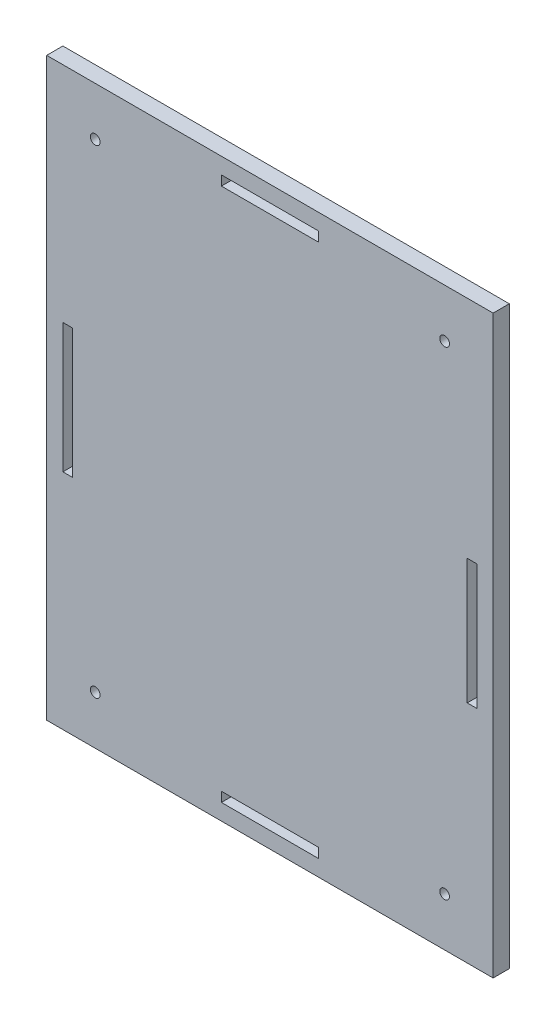
ISO-10303-21;
HEADER;
FILE_DESCRIPTION(('STEP AP214'),'2;1');
FILE_NAME('part.step','',(''),(''),'','','');
FILE_SCHEMA(('AUTOMOTIVE_DESIGN { 1 0 10303 214 1 1 1 1 }'));
ENDSEC;
DATA;
#1=APPLICATION_CONTEXT('core data for automotive mechanical design processes');
#2=APPLICATION_PROTOCOL_DEFINITION('international standard','automotive_design',2000,#1);
#3=PRODUCT_CONTEXT('',#1,'mechanical');
#4=PRODUCT('Part','Part','',(#3));
#5=PRODUCT_RELATED_PRODUCT_CATEGORY('part','',(#4));
#6=PRODUCT_DEFINITION_FORMATION('','',#4);
#7=PRODUCT_DEFINITION_CONTEXT('part definition',#1,'design');
#8=PRODUCT_DEFINITION('design','',#6,#7);
#9=PRODUCT_DEFINITION_SHAPE('','',#8);
#10=(LENGTH_UNIT() NAMED_UNIT(*) SI_UNIT(.MILLI.,.METRE.));
#11=(NAMED_UNIT(*) PLANE_ANGLE_UNIT() SI_UNIT($,.RADIAN.));
#12=(NAMED_UNIT(*) SI_UNIT($,.STERADIAN.) SOLID_ANGLE_UNIT());
#13=UNCERTAINTY_MEASURE_WITH_UNIT(LENGTH_MEASURE(1.E-05),#10,'distance_accuracy_value','');
#14=(GEOMETRIC_REPRESENTATION_CONTEXT(3) GLOBAL_UNCERTAINTY_ASSIGNED_CONTEXT((#13)) GLOBAL_UNIT_ASSIGNED_CONTEXT((#10,
#11,#12)) REPRESENTATION_CONTEXT('',''));
#15=CARTESIAN_POINT('',(0.,0.,0.));
#16=DIRECTION('',(0.,0.,1.));
#17=DIRECTION('',(1.,0.,0.));
#18=AXIS2_PLACEMENT_3D('',#15,#16,#17);
#19=CARTESIAN_POINT('',(-69.,-89.,5.));
#20=DIRECTION('',(1.,0.,0.));
#21=DIRECTION('',(0.,0.,-1.));
#22=AXIS2_PLACEMENT_3D('',#19,#20,#21);
#23=PLANE('',#22);
#24=DIRECTION('',(0.,-1.,0.));
#25=VECTOR('',#24,1.);
#26=CARTESIAN_POINT('',(-69.,-89.,0.));
#27=LINE('',#26,#25);
#28=CARTESIAN_POINT('',(-69.,89.,0.));
#29=VERTEX_POINT('',#28);
#30=CARTESIAN_POINT('',(-69.,-89.,0.));
#31=VERTEX_POINT('',#30);
#32=EDGE_CURVE('E262',#29,#31,#27,.T.);
#33=ORIENTED_EDGE('',*,*,#32,.T.);
#34=DIRECTION('',(0.,0.,-1.));
#35=VECTOR('',#34,1.);
#36=CARTESIAN_POINT('',(-69.,-89.,5.));
#37=LINE('',#36,#35);
#38=CARTESIAN_POINT('',(-69.,-89.,5.));
#39=VERTEX_POINT('',#38);
#40=EDGE_CURVE('E295',#39,#31,#37,.T.);
#41=ORIENTED_EDGE('',*,*,#40,.F.);
#42=DIRECTION('',(0.,-1.,0.));
#43=VECTOR('',#42,1.);
#44=CARTESIAN_POINT('',(-69.,-89.,5.));
#45=LINE('',#44,#43);
#46=CARTESIAN_POINT('',(-69.,89.,5.));
#47=VERTEX_POINT('',#46);
#48=EDGE_CURVE('E269',#47,#39,#45,.T.);
#49=ORIENTED_EDGE('',*,*,#48,.F.);
#50=DIRECTION('',(0.,0.,-1.));
#51=VECTOR('',#50,1.);
#52=CARTESIAN_POINT('',(-69.,89.,5.));
#53=LINE('',#52,#51);
#54=EDGE_CURVE('E279',#47,#29,#53,.T.);
#55=ORIENTED_EDGE('',*,*,#54,.T.);
#56=EDGE_LOOP('',(#33,#41,#49,#55));
#57=FACE_BOUND('',#56,.T.);
#58=ADVANCED_FACE('F32',(#57),#23,.F.);
#59=CARTESIAN_POINT('',(69.,-89.,5.));
#60=DIRECTION('',(0.,1.,0.));
#61=DIRECTION('',(-1.,0.,0.));
#62=AXIS2_PLACEMENT_3D('',#59,#60,#61);
#63=PLANE('',#62);
#64=DIRECTION('',(1.,0.,0.));
#65=VECTOR('',#64,1.);
#66=CARTESIAN_POINT('',(69.,-89.,0.));
#67=LINE('',#66,#65);
#68=CARTESIAN_POINT('',(69.,-89.,0.));
#69=VERTEX_POINT('',#68);
#70=EDGE_CURVE('E282',#31,#69,#67,.T.);
#71=ORIENTED_EDGE('',*,*,#70,.T.);
#72=DIRECTION('',(0.,0.,-1.));
#73=VECTOR('',#72,1.);
#74=CARTESIAN_POINT('',(69.,-89.,5.));
#75=LINE('',#74,#73);
#76=CARTESIAN_POINT('',(69.,-89.,5.));
#77=VERTEX_POINT('',#76);
#78=EDGE_CURVE('E292',#77,#69,#75,.T.);
#79=ORIENTED_EDGE('',*,*,#78,.F.);
#80=DIRECTION('',(1.,0.,0.));
#81=VECTOR('',#80,1.);
#82=CARTESIAN_POINT('',(69.,-89.,5.));
#83=LINE('',#82,#81);
#84=EDGE_CURVE('E272',#39,#77,#83,.T.);
#85=ORIENTED_EDGE('',*,*,#84,.F.);
#86=ORIENTED_EDGE('',*,*,#40,.T.);
#87=EDGE_LOOP('',(#71,#79,#85,#86));
#88=FACE_BOUND('',#87,.T.);
#89=ADVANCED_FACE('F346',(#88),#63,.F.);
#90=CARTESIAN_POINT('',(69.,-89.,5.));
#91=DIRECTION('',(-1.,0.,0.));
#92=DIRECTION('',(0.,0.,1.));
#93=AXIS2_PLACEMENT_3D('',#90,#91,#92);
#94=PLANE('',#93);
#95=DIRECTION('',(0.,1.,0.));
#96=VECTOR('',#95,1.);
#97=CARTESIAN_POINT('',(69.,-89.,0.));
#98=LINE('',#97,#96);
#99=CARTESIAN_POINT('',(69.,89.,0.));
#100=VERTEX_POINT('',#99);
#101=EDGE_CURVE('E284',#69,#100,#98,.T.);
#102=ORIENTED_EDGE('',*,*,#101,.T.);
#103=DIRECTION('',(0.,0.,-1.));
#104=VECTOR('',#103,1.);
#105=CARTESIAN_POINT('',(69.,89.,5.));
#106=LINE('',#105,#104);
#107=CARTESIAN_POINT('',(69.,89.,5.));
#108=VERTEX_POINT('',#107);
#109=EDGE_CURVE('E289',#108,#100,#106,.T.);
#110=ORIENTED_EDGE('',*,*,#109,.F.);
#111=DIRECTION('',(0.,1.,0.));
#112=VECTOR('',#111,1.);
#113=CARTESIAN_POINT('',(69.,-89.,5.));
#114=LINE('',#113,#112);
#115=EDGE_CURVE('E275',#77,#108,#114,.T.);
#116=ORIENTED_EDGE('',*,*,#115,.F.);
#117=ORIENTED_EDGE('',*,*,#78,.T.);
#118=EDGE_LOOP('',(#102,#110,#116,#117));
#119=FACE_BOUND('',#118,.T.);
#120=ADVANCED_FACE('F351',(#119),#94,.F.);
#121=CARTESIAN_POINT('',(69.,89.,5.));
#122=DIRECTION('',(0.,-1.,0.));
#123=DIRECTION('',(1.,0.,0.));
#124=AXIS2_PLACEMENT_3D('',#121,#122,#123);
#125=PLANE('',#124);
#126=DIRECTION('',(-1.,0.,0.));
#127=VECTOR('',#126,1.);
#128=CARTESIAN_POINT('',(69.,89.,0.));
#129=LINE('',#128,#127);
#130=EDGE_CURVE('E273',#100,#29,#129,.T.);
#131=ORIENTED_EDGE('',*,*,#130,.T.);
#132=ORIENTED_EDGE('',*,*,#54,.F.);
#133=DIRECTION('',(-1.,0.,0.));
#134=VECTOR('',#133,1.);
#135=CARTESIAN_POINT('',(69.,89.,5.));
#136=LINE('',#135,#134);
#137=EDGE_CURVE('E277',#108,#47,#136,.T.);
#138=ORIENTED_EDGE('',*,*,#137,.F.);
#139=ORIENTED_EDGE('',*,*,#109,.T.);
#140=EDGE_LOOP('',(#131,#132,#138,#139));
#141=FACE_BOUND('',#140,.T.);
#142=ADVANCED_FACE('F366',(#141),#125,.F.);
#143=CARTESIAN_POINT('',(0.,0.,5.));
#144=DIRECTION('',(0.,0.,1.));
#145=DIRECTION('',(1.,0.,0.));
#146=AXIS2_PLACEMENT_3D('',#143,#144,#145);
#147=PLANE('',#146);
#148=CARTESIAN_POINT('',(54.,74.,5.));
#149=DIRECTION('',(0.,0.,1.));
#150=DIRECTION('',(1.,0.,0.));
#151=AXIS2_PLACEMENT_3D('',#148,#149,#150);
#152=CIRCLE('',#151,1.49999999999995);
#153=CARTESIAN_POINT('',(55.4999999999999,74.,5.));
#154=VERTEX_POINT('',#153);
#155=EDGE_CURVE('E551',#154,#154,#152,.T.);
#156=ORIENTED_EDGE('',*,*,#155,.F.);
#157=EDGE_LOOP('',(#156));
#158=FACE_BOUND('',#157,.T.);
#159=CARTESIAN_POINT('',(-54.,74.,5.));
#160=DIRECTION('',(0.,0.,1.));
#161=DIRECTION('',(1.,0.,0.));
#162=AXIS2_PLACEMENT_3D('',#159,#160,#161);
#163=CIRCLE('',#162,1.5);
#164=CARTESIAN_POINT('',(-52.5,74.,5.));
#165=VERTEX_POINT('',#164);
#166=EDGE_CURVE('E557',#165,#165,#163,.T.);
#167=ORIENTED_EDGE('',*,*,#166,.F.);
#168=EDGE_LOOP('',(#167));
#169=FACE_BOUND('',#168,.T.);
#170=CARTESIAN_POINT('',(-54.,-74.,5.));
#171=DIRECTION('',(0.,0.,1.));
#172=DIRECTION('',(1.,0.,0.));
#173=AXIS2_PLACEMENT_3D('',#170,#171,#172);
#174=CIRCLE('',#173,1.5);
#175=CARTESIAN_POINT('',(-52.5,-74.,5.));
#176=VERTEX_POINT('',#175);
#177=EDGE_CURVE('E565',#176,#176,#174,.T.);
#178=ORIENTED_EDGE('',*,*,#177,.F.);
#179=EDGE_LOOP('',(#178));
#180=FACE_BOUND('',#179,.T.);
#181=CARTESIAN_POINT('',(54.,-74.,5.));
#182=DIRECTION('',(0.,0.,1.));
#183=DIRECTION('',(1.,0.,0.));
#184=AXIS2_PLACEMENT_3D('',#181,#182,#183);
#185=CIRCLE('',#184,1.49999999999995);
#186=CARTESIAN_POINT('',(55.4999999999999,-74.,5.));
#187=VERTEX_POINT('',#186);
#188=EDGE_CURVE('E554',#187,#187,#185,.T.);
#189=ORIENTED_EDGE('',*,*,#188,.F.);
#190=EDGE_LOOP('',(#189));
#191=FACE_BOUND('',#190,.T.);
#192=DIRECTION('',(0.,1.,0.));
#193=VECTOR('',#192,1.);
#194=CARTESIAN_POINT('',(-61.,20.,5.));
#195=LINE('',#194,#193);
#196=CARTESIAN_POINT('',(-61.,-20.,5.));
#197=VERTEX_POINT('',#196);
#198=CARTESIAN_POINT('',(-61.,20.,5.));
#199=VERTEX_POINT('',#198);
#200=EDGE_CURVE('E46',#197,#199,#195,.T.);
#201=ORIENTED_EDGE('',*,*,#200,.F.);
#202=DIRECTION('',(1.,0.,0.));
#203=VECTOR('',#202,1.);
#204=CARTESIAN_POINT('',(-64.,-20.,5.));
#205=LINE('',#204,#203);
#206=CARTESIAN_POINT('',(-64.,-20.,5.));
#207=VERTEX_POINT('',#206);
#208=EDGE_CURVE('E187',#207,#197,#205,.T.);
#209=ORIENTED_EDGE('',*,*,#208,.F.);
#210=DIRECTION('',(0.,-1.,0.));
#211=VECTOR('',#210,1.);
#212=CARTESIAN_POINT('',(-64.,20.,5.));
#213=LINE('',#212,#211);
#214=CARTESIAN_POINT('',(-64.,20.,5.));
#215=VERTEX_POINT('',#214);
#216=EDGE_CURVE('E171',#215,#207,#213,.T.);
#217=ORIENTED_EDGE('',*,*,#216,.F.);
#218=DIRECTION('',(-1.,0.,0.));
#219=VECTOR('',#218,1.);
#220=CARTESIAN_POINT('',(-64.,20.,5.));
#221=LINE('',#220,#219);
#222=EDGE_CURVE('E180',#199,#215,#221,.T.);
#223=ORIENTED_EDGE('',*,*,#222,.F.);
#224=EDGE_LOOP('',(#201,#209,#217,#223));
#225=FACE_BOUND('',#224,.T.);
#226=DIRECTION('',(0.,1.,0.));
#227=VECTOR('',#226,1.);
#228=CARTESIAN_POINT('',(64.,19.3548387096774,5.));
#229=LINE('',#228,#227);
#230=CARTESIAN_POINT('',(64.,-19.3548387096774,5.));
#231=VERTEX_POINT('',#230);
#232=CARTESIAN_POINT('',(64.,19.3548387096774,5.));
#233=VERTEX_POINT('',#232);
#234=EDGE_CURVE('E194',#231,#233,#229,.T.);
#235=ORIENTED_EDGE('',*,*,#234,.F.);
#236=DIRECTION('',(1.,0.,0.));
#237=VECTOR('',#236,1.);
#238=CARTESIAN_POINT('',(61.,-19.3548387096774,5.));
#239=LINE('',#238,#237);
#240=CARTESIAN_POINT('',(61.,-19.3548387096774,5.));
#241=VERTEX_POINT('',#240);
#242=EDGE_CURVE('E204',#241,#231,#239,.T.);
#243=ORIENTED_EDGE('',*,*,#242,.F.);
#244=DIRECTION('',(0.,-1.,0.));
#245=VECTOR('',#244,1.);
#246=CARTESIAN_POINT('',(61.,19.3548387096774,5.));
#247=LINE('',#246,#245);
#248=CARTESIAN_POINT('',(61.,19.3548387096774,5.));
#249=VERTEX_POINT('',#248);
#250=EDGE_CURVE('E201',#249,#241,#247,.T.);
#251=ORIENTED_EDGE('',*,*,#250,.F.);
#252=DIRECTION('',(-1.,0.,0.));
#253=VECTOR('',#252,1.);
#254=CARTESIAN_POINT('',(61.,19.3548387096774,5.));
#255=LINE('',#254,#253);
#256=EDGE_CURVE('E198',#233,#249,#255,.T.);
#257=ORIENTED_EDGE('',*,*,#256,.F.);
#258=EDGE_LOOP('',(#235,#243,#251,#257));
#259=FACE_BOUND('',#258,.T.);
#260=DIRECTION('',(0.,1.,0.));
#261=VECTOR('',#260,1.);
#262=CARTESIAN_POINT('',(15.0000000000001,-81.,5.));
#263=LINE('',#262,#261);
#264=CARTESIAN_POINT('',(15.0000000000001,-84.,5.));
#265=VERTEX_POINT('',#264);
#266=CARTESIAN_POINT('',(15.0000000000001,-81.,5.));
#267=VERTEX_POINT('',#266);
#268=EDGE_CURVE('E210',#265,#267,#263,.T.);
#269=ORIENTED_EDGE('',*,*,#268,.F.);
#270=DIRECTION('',(1.,0.,0.));
#271=VECTOR('',#270,1.);
#272=CARTESIAN_POINT('',(-15.0000000000001,-84.,5.));
#273=LINE('',#272,#271);
#274=CARTESIAN_POINT('',(-15.0000000000001,-84.,5.));
#275=VERTEX_POINT('',#274);
#276=EDGE_CURVE('E224',#275,#265,#273,.T.);
#277=ORIENTED_EDGE('',*,*,#276,.F.);
#278=DIRECTION('',(0.,-1.,0.));
#279=VECTOR('',#278,1.);
#280=CARTESIAN_POINT('',(-15.0000000000001,-81.,5.));
#281=LINE('',#280,#279);
#282=CARTESIAN_POINT('',(-15.0000000000001,-81.,5.));
#283=VERTEX_POINT('',#282);
#284=EDGE_CURVE('E221',#283,#275,#281,.T.);
#285=ORIENTED_EDGE('',*,*,#284,.F.);
#286=DIRECTION('',(-1.,0.,0.));
#287=VECTOR('',#286,1.);
#288=CARTESIAN_POINT('',(-15.0000000000001,-81.,5.));
#289=LINE('',#288,#287);
#290=EDGE_CURVE('E218',#267,#283,#289,.T.);
#291=ORIENTED_EDGE('',*,*,#290,.F.);
#292=EDGE_LOOP('',(#269,#277,#285,#291));
#293=FACE_BOUND('',#292,.T.);
#294=DIRECTION('',(0.,1.,0.));
#295=VECTOR('',#294,1.);
#296=CARTESIAN_POINT('',(15.0000000000001,84.,5.));
#297=LINE('',#296,#295);
#298=CARTESIAN_POINT('',(15.0000000000001,81.,5.));
#299=VERTEX_POINT('',#298);
#300=CARTESIAN_POINT('',(15.0000000000001,84.,5.));
#301=VERTEX_POINT('',#300);
#302=EDGE_CURVE('E230',#299,#301,#297,.T.);
#303=ORIENTED_EDGE('',*,*,#302,.F.);
#304=DIRECTION('',(1.,0.,0.));
#305=VECTOR('',#304,1.);
#306=CARTESIAN_POINT('',(-15.0000000000001,81.,5.));
#307=LINE('',#306,#305);
#308=CARTESIAN_POINT('',(-15.0000000000001,81.,5.));
#309=VERTEX_POINT('',#308);
#310=EDGE_CURVE('E241',#309,#299,#307,.T.);
#311=ORIENTED_EDGE('',*,*,#310,.F.);
#312=DIRECTION('',(0.,-1.,0.));
#313=VECTOR('',#312,1.);
#314=CARTESIAN_POINT('',(-15.0000000000001,84.,5.));
#315=LINE('',#314,#313);
#316=CARTESIAN_POINT('',(-15.0000000000001,84.,5.));
#317=VERTEX_POINT('',#316);
#318=EDGE_CURVE('E255',#317,#309,#315,.T.);
#319=ORIENTED_EDGE('',*,*,#318,.F.);
#320=DIRECTION('',(-1.,0.,0.));
#321=VECTOR('',#320,1.);
#322=CARTESIAN_POINT('',(-15.0000000000001,84.,5.));
#323=LINE('',#322,#321);
#324=EDGE_CURVE('E252',#301,#317,#323,.T.);
#325=ORIENTED_EDGE('',*,*,#324,.F.);
#326=EDGE_LOOP('',(#303,#311,#319,#325));
#327=FACE_BOUND('',#326,.T.);
#328=ORIENTED_EDGE('',*,*,#48,.T.);
#329=ORIENTED_EDGE('',*,*,#84,.T.);
#330=ORIENTED_EDGE('',*,*,#115,.T.);
#331=ORIENTED_EDGE('',*,*,#137,.T.);
#332=EDGE_LOOP('',(#328,#329,#330,#331));
#333=FACE_BOUND('',#332,.T.);
#334=ADVANCED_FACE('F184',(#158,#169,#180,#191,#225,#259,#293,#327,#333),#147,.T.);
#335=CARTESIAN_POINT('',(0.,0.,0.));
#336=DIRECTION('',(0.,0.,1.));
#337=DIRECTION('',(1.,0.,0.));
#338=AXIS2_PLACEMENT_3D('',#335,#336,#337);
#339=PLANE('',#338);
#340=CARTESIAN_POINT('',(54.,74.,0.));
#341=DIRECTION('',(0.,0.,1.));
#342=DIRECTION('',(1.,0.,0.));
#343=AXIS2_PLACEMENT_3D('',#340,#341,#342);
#344=CIRCLE('',#343,1.49999999999995);
#345=CARTESIAN_POINT('',(55.4999999999999,74.,0.));
#346=VERTEX_POINT('',#345);
#347=EDGE_CURVE('E548',#346,#346,#344,.T.);
#348=ORIENTED_EDGE('',*,*,#347,.T.);
#349=EDGE_LOOP('',(#348));
#350=FACE_BOUND('',#349,.T.);
#351=CARTESIAN_POINT('',(-54.,74.,0.));
#352=DIRECTION('',(0.,0.,1.));
#353=DIRECTION('',(1.,0.,0.));
#354=AXIS2_PLACEMENT_3D('',#351,#352,#353);
#355=CIRCLE('',#354,1.5);
#356=CARTESIAN_POINT('',(-52.5,74.,0.));
#357=VERTEX_POINT('',#356);
#358=EDGE_CURVE('E552',#357,#357,#355,.T.);
#359=ORIENTED_EDGE('',*,*,#358,.T.);
#360=EDGE_LOOP('',(#359));
#361=FACE_BOUND('',#360,.T.);
#362=CARTESIAN_POINT('',(-54.,-74.,0.));
#363=DIRECTION('',(0.,0.,1.));
#364=DIRECTION('',(1.,0.,0.));
#365=AXIS2_PLACEMENT_3D('',#362,#363,#364);
#366=CIRCLE('',#365,1.5);
#367=CARTESIAN_POINT('',(-52.5,-74.,0.));
#368=VERTEX_POINT('',#367);
#369=EDGE_CURVE('E562',#368,#368,#366,.T.);
#370=ORIENTED_EDGE('',*,*,#369,.T.);
#371=EDGE_LOOP('',(#370));
#372=FACE_BOUND('',#371,.T.);
#373=CARTESIAN_POINT('',(54.,-74.,0.));
#374=DIRECTION('',(0.,0.,1.));
#375=DIRECTION('',(1.,0.,0.));
#376=AXIS2_PLACEMENT_3D('',#373,#374,#375);
#377=CIRCLE('',#376,1.49999999999995);
#378=CARTESIAN_POINT('',(55.4999999999999,-74.,0.));
#379=VERTEX_POINT('',#378);
#380=EDGE_CURVE('E568',#379,#379,#377,.T.);
#381=ORIENTED_EDGE('',*,*,#380,.T.);
#382=EDGE_LOOP('',(#381));
#383=FACE_BOUND('',#382,.T.);
#384=DIRECTION('',(1.,0.,0.));
#385=VECTOR('',#384,1.);
#386=CARTESIAN_POINT('',(0.,-20.,0.));
#387=LINE('',#386,#385);
#388=CARTESIAN_POINT('',(-64.,-20.,0.));
#389=VERTEX_POINT('',#388);
#390=CARTESIAN_POINT('',(-61.,-20.,0.));
#391=VERTEX_POINT('',#390);
#392=EDGE_CURVE('E39',#389,#391,#387,.T.);
#393=ORIENTED_EDGE('',*,*,#392,.T.);
#394=DIRECTION('',(0.,1.,0.));
#395=VECTOR('',#394,1.);
#396=CARTESIAN_POINT('',(-61.,0.,0.));
#397=LINE('',#396,#395);
#398=CARTESIAN_POINT('',(-61.,20.,0.));
#399=VERTEX_POINT('',#398);
#400=EDGE_CURVE('E11',#391,#399,#397,.T.);
#401=ORIENTED_EDGE('',*,*,#400,.T.);
#402=DIRECTION('',(-1.,0.,0.));
#403=VECTOR('',#402,1.);
#404=CARTESIAN_POINT('',(0.,20.,0.));
#405=LINE('',#404,#403);
#406=CARTESIAN_POINT('',(-64.,20.,0.));
#407=VERTEX_POINT('',#406);
#408=EDGE_CURVE('E322',#399,#407,#405,.T.);
#409=ORIENTED_EDGE('',*,*,#408,.T.);
#410=DIRECTION('',(0.,-1.,0.));
#411=VECTOR('',#410,1.);
#412=CARTESIAN_POINT('',(-64.,0.,0.));
#413=LINE('',#412,#411);
#414=EDGE_CURVE('E174',#407,#389,#413,.T.);
#415=ORIENTED_EDGE('',*,*,#414,.T.);
#416=EDGE_LOOP('',(#393,#401,#409,#415));
#417=FACE_BOUND('',#416,.T.);
#418=DIRECTION('',(1.,0.,0.));
#419=VECTOR('',#418,1.);
#420=CARTESIAN_POINT('',(0.,-19.3548387096774,0.));
#421=LINE('',#420,#419);
#422=CARTESIAN_POINT('',(61.,-19.3548387096774,0.));
#423=VERTEX_POINT('',#422);
#424=CARTESIAN_POINT('',(64.,-19.3548387096774,0.));
#425=VERTEX_POINT('',#424);
#426=EDGE_CURVE('E316',#423,#425,#421,.T.);
#427=ORIENTED_EDGE('',*,*,#426,.T.);
#428=DIRECTION('',(0.,1.,0.));
#429=VECTOR('',#428,1.);
#430=CARTESIAN_POINT('',(64.,0.,0.));
#431=LINE('',#430,#429);
#432=CARTESIAN_POINT('',(64.,19.3548387096774,0.));
#433=VERTEX_POINT('',#432);
#434=EDGE_CURVE('E319',#425,#433,#431,.T.);
#435=ORIENTED_EDGE('',*,*,#434,.T.);
#436=DIRECTION('',(-1.,0.,0.));
#437=VECTOR('',#436,1.);
#438=CARTESIAN_POINT('',(0.,19.3548387096774,0.));
#439=LINE('',#438,#437);
#440=CARTESIAN_POINT('',(61.,19.3548387096774,0.));
#441=VERTEX_POINT('',#440);
#442=EDGE_CURVE('E310',#433,#441,#439,.T.);
#443=ORIENTED_EDGE('',*,*,#442,.T.);
#444=DIRECTION('',(0.,-1.,0.));
#445=VECTOR('',#444,1.);
#446=CARTESIAN_POINT('',(61.,0.,0.));
#447=LINE('',#446,#445);
#448=EDGE_CURVE('E313',#441,#423,#447,.T.);
#449=ORIENTED_EDGE('',*,*,#448,.T.);
#450=EDGE_LOOP('',(#427,#435,#443,#449));
#451=FACE_BOUND('',#450,.T.);
#452=DIRECTION('',(1.,0.,0.));
#453=VECTOR('',#452,1.);
#454=CARTESIAN_POINT('',(0.,-84.,0.));
#455=LINE('',#454,#453);
#456=CARTESIAN_POINT('',(-15.0000000000001,-84.,0.));
#457=VERTEX_POINT('',#456);
#458=CARTESIAN_POINT('',(15.0000000000001,-84.,0.));
#459=VERTEX_POINT('',#458);
#460=EDGE_CURVE('E304',#457,#459,#455,.T.);
#461=ORIENTED_EDGE('',*,*,#460,.T.);
#462=DIRECTION('',(0.,1.,0.));
#463=VECTOR('',#462,1.);
#464=CARTESIAN_POINT('',(15.0000000000001,0.,0.));
#465=LINE('',#464,#463);
#466=CARTESIAN_POINT('',(15.0000000000001,-81.,0.));
#467=VERTEX_POINT('',#466);
#468=EDGE_CURVE('E307',#459,#467,#465,.T.);
#469=ORIENTED_EDGE('',*,*,#468,.T.);
#470=DIRECTION('',(-1.,0.,0.));
#471=VECTOR('',#470,1.);
#472=CARTESIAN_POINT('',(0.,-81.,0.));
#473=LINE('',#472,#471);
#474=CARTESIAN_POINT('',(-15.0000000000001,-81.,0.));
#475=VERTEX_POINT('',#474);
#476=EDGE_CURVE('E298',#467,#475,#473,.T.);
#477=ORIENTED_EDGE('',*,*,#476,.T.);
#478=DIRECTION('',(0.,-1.,0.));
#479=VECTOR('',#478,1.);
#480=CARTESIAN_POINT('',(-15.0000000000001,0.,0.));
#481=LINE('',#480,#479);
#482=EDGE_CURVE('E301',#475,#457,#481,.T.);
#483=ORIENTED_EDGE('',*,*,#482,.T.);
#484=EDGE_LOOP('',(#461,#469,#477,#483));
#485=FACE_BOUND('',#484,.T.);
#486=DIRECTION('',(1.,0.,0.));
#487=VECTOR('',#486,1.);
#488=CARTESIAN_POINT('',(-15.0000000000001,81.,0.));
#489=LINE('',#488,#487);
#490=CARTESIAN_POINT('',(-15.0000000000001,81.,0.));
#491=VERTEX_POINT('',#490);
#492=CARTESIAN_POINT('',(15.0000000000001,81.,0.));
#493=VERTEX_POINT('',#492);
#494=EDGE_CURVE('E247',#491,#493,#489,.T.);
#495=ORIENTED_EDGE('',*,*,#494,.T.);
#496=DIRECTION('',(0.,1.,0.));
#497=VECTOR('',#496,1.);
#498=CARTESIAN_POINT('',(15.0000000000001,84.,0.));
#499=LINE('',#498,#497);
#500=CARTESIAN_POINT('',(15.0000000000001,84.,0.));
#501=VERTEX_POINT('',#500);
#502=EDGE_CURVE('E237',#493,#501,#499,.T.);
#503=ORIENTED_EDGE('',*,*,#502,.T.);
#504=DIRECTION('',(-1.,0.,0.));
#505=VECTOR('',#504,1.);
#506=CARTESIAN_POINT('',(-15.0000000000001,84.,0.));
#507=LINE('',#506,#505);
#508=CARTESIAN_POINT('',(-15.0000000000001,84.,0.));
#509=VERTEX_POINT('',#508);
#510=EDGE_CURVE('E240',#501,#509,#507,.T.);
#511=ORIENTED_EDGE('',*,*,#510,.T.);
#512=DIRECTION('',(0.,-1.,0.));
#513=VECTOR('',#512,1.);
#514=CARTESIAN_POINT('',(-15.0000000000001,84.,0.));
#515=LINE('',#514,#513);
#516=EDGE_CURVE('E244',#509,#491,#515,.T.);
#517=ORIENTED_EDGE('',*,*,#516,.T.);
#518=EDGE_LOOP('',(#495,#503,#511,#517));
#519=FACE_BOUND('',#518,.T.);
#520=ORIENTED_EDGE('',*,*,#32,.F.);
#521=ORIENTED_EDGE('',*,*,#130,.F.);
#522=ORIENTED_EDGE('',*,*,#101,.F.);
#523=ORIENTED_EDGE('',*,*,#70,.F.);
#524=EDGE_LOOP('',(#520,#521,#522,#523));
#525=FACE_BOUND('',#524,.T.);
#526=ADVANCED_FACE('F326',(#350,#361,#372,#383,#417,#451,#485,#519,#525),#339,.F.);
#527=CARTESIAN_POINT('',(15.0000000000001,84.,0.));
#528=DIRECTION('',(1.,0.,0.));
#529=DIRECTION('',(0.,0.,-1.));
#530=AXIS2_PLACEMENT_3D('',#527,#528,#529);
#531=PLANE('',#530);
#532=ORIENTED_EDGE('',*,*,#302,.T.);
#533=DIRECTION('',(0.,0.,1.));
#534=VECTOR('',#533,1.);
#535=CARTESIAN_POINT('',(15.0000000000001,84.,0.));
#536=LINE('',#535,#534);
#537=EDGE_CURVE('E250',#501,#301,#536,.T.);
#538=ORIENTED_EDGE('',*,*,#537,.F.);
#539=ORIENTED_EDGE('',*,*,#502,.F.);
#540=DIRECTION('',(0.,0.,1.));
#541=VECTOR('',#540,1.);
#542=CARTESIAN_POINT('',(15.0000000000001,81.,0.));
#543=LINE('',#542,#541);
#544=EDGE_CURVE('E260',#493,#299,#543,.T.);
#545=ORIENTED_EDGE('',*,*,#544,.T.);
#546=EDGE_LOOP('',(#532,#538,#539,#545));
#547=FACE_BOUND('',#546,.T.);
#548=ADVANCED_FACE('F377',(#547),#531,.F.);
#549=CARTESIAN_POINT('',(-15.0000000000001,81.,0.));
#550=DIRECTION('',(0.,-1.,0.));
#551=DIRECTION('',(0.,0.,-1.));
#552=AXIS2_PLACEMENT_3D('',#549,#550,#551);
#553=PLANE('',#552);
#554=ORIENTED_EDGE('',*,*,#310,.T.);
#555=ORIENTED_EDGE('',*,*,#544,.F.);
#556=ORIENTED_EDGE('',*,*,#494,.F.);
#557=DIRECTION('',(0.,0.,1.));
#558=VECTOR('',#557,1.);
#559=CARTESIAN_POINT('',(-15.0000000000001,81.,0.));
#560=LINE('',#559,#558);
#561=EDGE_CURVE('E263',#491,#309,#560,.T.);
#562=ORIENTED_EDGE('',*,*,#561,.T.);
#563=EDGE_LOOP('',(#554,#555,#556,#562));
#564=FACE_BOUND('',#563,.T.);
#565=ADVANCED_FACE('F384',(#564),#553,.F.);
#566=CARTESIAN_POINT('',(-15.0000000000001,84.,0.));
#567=DIRECTION('',(-1.,0.,0.));
#568=DIRECTION('',(0.,0.,1.));
#569=AXIS2_PLACEMENT_3D('',#566,#567,#568);
#570=PLANE('',#569);
#571=ORIENTED_EDGE('',*,*,#318,.T.);
#572=ORIENTED_EDGE('',*,*,#561,.F.);
#573=ORIENTED_EDGE('',*,*,#516,.F.);
#574=DIRECTION('',(0.,0.,1.));
#575=VECTOR('',#574,1.);
#576=CARTESIAN_POINT('',(-15.0000000000001,84.,0.));
#577=LINE('',#576,#575);
#578=EDGE_CURVE('E265',#509,#317,#577,.T.);
#579=ORIENTED_EDGE('',*,*,#578,.T.);
#580=EDGE_LOOP('',(#571,#572,#573,#579));
#581=FACE_BOUND('',#580,.T.);
#582=ADVANCED_FACE('F390',(#581),#570,.F.);
#583=CARTESIAN_POINT('',(-15.0000000000001,84.,0.));
#584=DIRECTION('',(0.,1.,0.));
#585=DIRECTION('',(0.,0.,1.));
#586=AXIS2_PLACEMENT_3D('',#583,#584,#585);
#587=PLANE('',#586);
#588=ORIENTED_EDGE('',*,*,#324,.T.);
#589=ORIENTED_EDGE('',*,*,#578,.F.);
#590=ORIENTED_EDGE('',*,*,#510,.F.);
#591=ORIENTED_EDGE('',*,*,#537,.T.);
#592=EDGE_LOOP('',(#588,#589,#590,#591));
#593=FACE_BOUND('',#592,.T.);
#594=ADVANCED_FACE('F386',(#593),#587,.F.);
#595=CARTESIAN_POINT('',(15.0000000000001,-81.,-3.));
#596=DIRECTION('',(1.,0.,0.));
#597=DIRECTION('',(0.,0.,-1.));
#598=AXIS2_PLACEMENT_3D('',#595,#596,#597);
#599=PLANE('',#598);
#600=DIRECTION('',(0.,0.,1.));
#601=VECTOR('',#600,1.);
#602=CARTESIAN_POINT('',(15.0000000000001,-84.,-3.));
#603=LINE('',#602,#601);
#604=EDGE_CURVE('E228',#459,#265,#603,.T.);
#605=ORIENTED_EDGE('',*,*,#604,.T.);
#606=ORIENTED_EDGE('',*,*,#268,.T.);
#607=DIRECTION('',(0.,0.,1.));
#608=VECTOR('',#607,1.);
#609=CARTESIAN_POINT('',(15.0000000000001,-81.,-3.));
#610=LINE('',#609,#608);
#611=EDGE_CURVE('E227',#467,#267,#610,.T.);
#612=ORIENTED_EDGE('',*,*,#611,.F.);
#613=ORIENTED_EDGE('',*,*,#468,.F.);
#614=EDGE_LOOP('',(#605,#606,#612,#613));
#615=FACE_BOUND('',#614,.T.);
#616=ADVANCED_FACE('F389',(#615),#599,.F.);
#617=CARTESIAN_POINT('',(-15.0000000000001,-84.,-3.));
#618=DIRECTION('',(0.,-1.,0.));
#619=DIRECTION('',(0.,0.,-1.));
#620=AXIS2_PLACEMENT_3D('',#617,#618,#619);
#621=PLANE('',#620);
#622=DIRECTION('',(0.,0.,1.));
#623=VECTOR('',#622,1.);
#624=CARTESIAN_POINT('',(-15.0000000000001,-84.,-3.));
#625=LINE('',#624,#623);
#626=EDGE_CURVE('E231',#457,#275,#625,.T.);
#627=ORIENTED_EDGE('',*,*,#626,.T.);
#628=ORIENTED_EDGE('',*,*,#276,.T.);
#629=ORIENTED_EDGE('',*,*,#604,.F.);
#630=ORIENTED_EDGE('',*,*,#460,.F.);
#631=EDGE_LOOP('',(#627,#628,#629,#630));
#632=FACE_BOUND('',#631,.T.);
#633=ADVANCED_FACE('F400',(#632),#621,.F.);
#634=CARTESIAN_POINT('',(-15.0000000000001,-81.,-3.));
#635=DIRECTION('',(-1.,0.,0.));
#636=DIRECTION('',(0.,0.,1.));
#637=AXIS2_PLACEMENT_3D('',#634,#635,#636);
#638=PLANE('',#637);
#639=DIRECTION('',(0.,0.,1.));
#640=VECTOR('',#639,1.);
#641=CARTESIAN_POINT('',(-15.0000000000001,-81.,-3.));
#642=LINE('',#641,#640);
#643=EDGE_CURVE('E233',#475,#283,#642,.T.);
#644=ORIENTED_EDGE('',*,*,#643,.T.);
#645=ORIENTED_EDGE('',*,*,#284,.T.);
#646=ORIENTED_EDGE('',*,*,#626,.F.);
#647=ORIENTED_EDGE('',*,*,#482,.F.);
#648=EDGE_LOOP('',(#644,#645,#646,#647));
#649=FACE_BOUND('',#648,.T.);
#650=ADVANCED_FACE('F406',(#649),#638,.F.);
#651=CARTESIAN_POINT('',(-15.0000000000001,-81.,-3.));
#652=DIRECTION('',(0.,1.,0.));
#653=DIRECTION('',(0.,0.,1.));
#654=AXIS2_PLACEMENT_3D('',#651,#652,#653);
#655=PLANE('',#654);
#656=ORIENTED_EDGE('',*,*,#611,.T.);
#657=ORIENTED_EDGE('',*,*,#290,.T.);
#658=ORIENTED_EDGE('',*,*,#643,.F.);
#659=ORIENTED_EDGE('',*,*,#476,.F.);
#660=EDGE_LOOP('',(#656,#657,#658,#659));
#661=FACE_BOUND('',#660,.T.);
#662=ADVANCED_FACE('F402',(#661),#655,.F.);
#663=CARTESIAN_POINT('',(64.,19.3548387096774,-3.));
#664=DIRECTION('',(1.,0.,0.));
#665=DIRECTION('',(0.,0.,-1.));
#666=AXIS2_PLACEMENT_3D('',#663,#664,#665);
#667=PLANE('',#666);
#668=DIRECTION('',(0.,0.,1.));
#669=VECTOR('',#668,1.);
#670=CARTESIAN_POINT('',(64.,-19.3548387096774,-3.));
#671=LINE('',#670,#669);
#672=EDGE_CURVE('E208',#425,#231,#671,.T.);
#673=ORIENTED_EDGE('',*,*,#672,.T.);
#674=ORIENTED_EDGE('',*,*,#234,.T.);
#675=DIRECTION('',(0.,0.,1.));
#676=VECTOR('',#675,1.);
#677=CARTESIAN_POINT('',(64.,19.3548387096774,-3.));
#678=LINE('',#677,#676);
#679=EDGE_CURVE('E207',#433,#233,#678,.T.);
#680=ORIENTED_EDGE('',*,*,#679,.F.);
#681=ORIENTED_EDGE('',*,*,#434,.F.);
#682=EDGE_LOOP('',(#673,#674,#680,#681));
#683=FACE_BOUND('',#682,.T.);
#684=ADVANCED_FACE('F405',(#683),#667,.F.);
#685=CARTESIAN_POINT('',(61.,-19.3548387096774,-3.));
#686=DIRECTION('',(0.,-1.,0.));
#687=DIRECTION('',(0.,0.,-1.));
#688=AXIS2_PLACEMENT_3D('',#685,#686,#687);
#689=PLANE('',#688);
#690=DIRECTION('',(0.,0.,1.));
#691=VECTOR('',#690,1.);
#692=CARTESIAN_POINT('',(61.,-19.3548387096774,-3.));
#693=LINE('',#692,#691);
#694=EDGE_CURVE('E211',#423,#241,#693,.T.);
#695=ORIENTED_EDGE('',*,*,#694,.T.);
#696=ORIENTED_EDGE('',*,*,#242,.T.);
#697=ORIENTED_EDGE('',*,*,#672,.F.);
#698=ORIENTED_EDGE('',*,*,#426,.F.);
#699=EDGE_LOOP('',(#695,#696,#697,#698));
#700=FACE_BOUND('',#699,.T.);
#701=ADVANCED_FACE('F415',(#700),#689,.F.);
#702=CARTESIAN_POINT('',(61.,19.3548387096774,-3.));
#703=DIRECTION('',(-1.,0.,0.));
#704=DIRECTION('',(0.,-1.,0.));
#705=AXIS2_PLACEMENT_3D('',#702,#703,#704);
#706=PLANE('',#705);
#707=DIRECTION('',(0.,0.,1.));
#708=VECTOR('',#707,1.);
#709=CARTESIAN_POINT('',(61.,19.3548387096774,-3.));
#710=LINE('',#709,#708);
#711=EDGE_CURVE('E213',#441,#249,#710,.T.);
#712=ORIENTED_EDGE('',*,*,#711,.T.);
#713=ORIENTED_EDGE('',*,*,#250,.T.);
#714=ORIENTED_EDGE('',*,*,#694,.F.);
#715=ORIENTED_EDGE('',*,*,#448,.F.);
#716=EDGE_LOOP('',(#712,#713,#714,#715));
#717=FACE_BOUND('',#716,.T.);
#718=ADVANCED_FACE('F340',(#717),#706,.F.);
#719=CARTESIAN_POINT('',(61.,19.3548387096774,-3.));
#720=DIRECTION('',(0.,1.,0.));
#721=DIRECTION('',(0.,0.,1.));
#722=AXIS2_PLACEMENT_3D('',#719,#720,#721);
#723=PLANE('',#722);
#724=ORIENTED_EDGE('',*,*,#679,.T.);
#725=ORIENTED_EDGE('',*,*,#256,.T.);
#726=ORIENTED_EDGE('',*,*,#711,.F.);
#727=ORIENTED_EDGE('',*,*,#442,.F.);
#728=EDGE_LOOP('',(#724,#725,#726,#727));
#729=FACE_BOUND('',#728,.T.);
#730=ADVANCED_FACE('F333',(#729),#723,.F.);
#731=CARTESIAN_POINT('',(-61.,20.,-3.));
#732=DIRECTION('',(1.,0.,0.));
#733=DIRECTION('',(0.,1.,0.));
#734=AXIS2_PLACEMENT_3D('',#731,#732,#733);
#735=PLANE('',#734);
#736=DIRECTION('',(0.,0.,1.));
#737=VECTOR('',#736,1.);
#738=CARTESIAN_POINT('',(-61.,-20.,-3.));
#739=LINE('',#738,#737);
#740=EDGE_CURVE('E192',#391,#197,#739,.T.);
#741=ORIENTED_EDGE('',*,*,#740,.T.);
#742=ORIENTED_EDGE('',*,*,#200,.T.);
#743=DIRECTION('',(0.,0.,1.));
#744=VECTOR('',#743,1.);
#745=CARTESIAN_POINT('',(-61.,20.,-3.));
#746=LINE('',#745,#744);
#747=EDGE_CURVE('E177',#399,#199,#746,.T.);
#748=ORIENTED_EDGE('',*,*,#747,.F.);
#749=ORIENTED_EDGE('',*,*,#400,.F.);
#750=EDGE_LOOP('',(#741,#742,#748,#749));
#751=FACE_BOUND('',#750,.T.);
#752=ADVANCED_FACE('F331',(#751),#735,.F.);
#753=CARTESIAN_POINT('',(-64.,-20.,-3.));
#754=DIRECTION('',(0.,-1.,0.));
#755=DIRECTION('',(0.,0.,-1.));
#756=AXIS2_PLACEMENT_3D('',#753,#754,#755);
#757=PLANE('',#756);
#758=DIRECTION('',(0.,0.,1.));
#759=VECTOR('',#758,1.);
#760=CARTESIAN_POINT('',(-64.,-20.,-3.));
#761=LINE('',#760,#759);
#762=EDGE_CURVE('E176',#389,#207,#761,.T.);
#763=ORIENTED_EDGE('',*,*,#762,.T.);
#764=ORIENTED_EDGE('',*,*,#208,.T.);
#765=ORIENTED_EDGE('',*,*,#740,.F.);
#766=ORIENTED_EDGE('',*,*,#392,.F.);
#767=EDGE_LOOP('',(#763,#764,#765,#766));
#768=FACE_BOUND('',#767,.T.);
#769=ADVANCED_FACE('F330',(#768),#757,.F.);
#770=CARTESIAN_POINT('',(-64.,20.,-3.));
#771=DIRECTION('',(-1.,0.,0.));
#772=DIRECTION('',(0.,-1.,0.));
#773=AXIS2_PLACEMENT_3D('',#770,#771,#772);
#774=PLANE('',#773);
#775=DIRECTION('',(0.,0.,1.));
#776=VECTOR('',#775,1.);
#777=CARTESIAN_POINT('',(-64.,20.,-3.));
#778=LINE('',#777,#776);
#779=EDGE_CURVE('E54',#407,#215,#778,.T.);
#780=ORIENTED_EDGE('',*,*,#779,.T.);
#781=ORIENTED_EDGE('',*,*,#216,.T.);
#782=ORIENTED_EDGE('',*,*,#762,.F.);
#783=ORIENTED_EDGE('',*,*,#414,.F.);
#784=EDGE_LOOP('',(#780,#781,#782,#783));
#785=FACE_BOUND('',#784,.T.);
#786=ADVANCED_FACE('F168',(#785),#774,.F.);
#787=CARTESIAN_POINT('',(-64.,20.,-3.));
#788=DIRECTION('',(0.,1.,0.));
#789=DIRECTION('',(0.,0.,1.));
#790=AXIS2_PLACEMENT_3D('',#787,#788,#789);
#791=PLANE('',#790);
#792=ORIENTED_EDGE('',*,*,#747,.T.);
#793=ORIENTED_EDGE('',*,*,#222,.T.);
#794=ORIENTED_EDGE('',*,*,#779,.F.);
#795=ORIENTED_EDGE('',*,*,#408,.F.);
#796=EDGE_LOOP('',(#792,#793,#794,#795));
#797=FACE_BOUND('',#796,.T.);
#798=ADVANCED_FACE('F181',(#797),#791,.F.);
#799=CARTESIAN_POINT('',(54.,-74.,0.));
#800=DIRECTION('',(0.,0.,1.));
#801=DIRECTION('',(1.,0.,0.));
#802=AXIS2_PLACEMENT_3D('',#799,#800,#801);
#803=CYLINDRICAL_SURFACE('',#802,1.49999999999995);
#804=ORIENTED_EDGE('',*,*,#380,.F.);
#805=EDGE_LOOP('',(#804));
#806=FACE_BOUND('',#805,.T.);
#807=ORIENTED_EDGE('',*,*,#188,.T.);
#808=EDGE_LOOP('',(#807));
#809=FACE_BOUND('',#808,.T.);
#810=ADVANCED_FACE('F489',(#806,#809),#803,.F.);
#811=CARTESIAN_POINT('',(-54.,-74.,0.));
#812=DIRECTION('',(0.,0.,1.));
#813=DIRECTION('',(1.,0.,0.));
#814=AXIS2_PLACEMENT_3D('',#811,#812,#813);
#815=CYLINDRICAL_SURFACE('',#814,1.5);
#816=ORIENTED_EDGE('',*,*,#369,.F.);
#817=EDGE_LOOP('',(#816));
#818=FACE_BOUND('',#817,.T.);
#819=ORIENTED_EDGE('',*,*,#177,.T.);
#820=EDGE_LOOP('',(#819));
#821=FACE_BOUND('',#820,.T.);
#822=ADVANCED_FACE('F511',(#818,#821),#815,.F.);
#823=CARTESIAN_POINT('',(-54.,74.,0.));
#824=DIRECTION('',(0.,0.,1.));
#825=DIRECTION('',(1.,0.,0.));
#826=AXIS2_PLACEMENT_3D('',#823,#824,#825);
#827=CYLINDRICAL_SURFACE('',#826,1.5);
#828=ORIENTED_EDGE('',*,*,#358,.F.);
#829=EDGE_LOOP('',(#828));
#830=FACE_BOUND('',#829,.T.);
#831=ORIENTED_EDGE('',*,*,#166,.T.);
#832=EDGE_LOOP('',(#831));
#833=FACE_BOUND('',#832,.T.);
#834=ADVANCED_FACE('F521',(#830,#833),#827,.F.);
#835=CARTESIAN_POINT('',(54.,74.,0.));
#836=DIRECTION('',(0.,0.,1.));
#837=DIRECTION('',(1.,0.,0.));
#838=AXIS2_PLACEMENT_3D('',#835,#836,#837);
#839=CYLINDRICAL_SURFACE('',#838,1.49999999999995);
#840=ORIENTED_EDGE('',*,*,#347,.F.);
#841=EDGE_LOOP('',(#840));
#842=FACE_BOUND('',#841,.T.);
#843=ORIENTED_EDGE('',*,*,#155,.T.);
#844=EDGE_LOOP('',(#843));
#845=FACE_BOUND('',#844,.T.);
#846=ADVANCED_FACE('F531',(#842,#845),#839,.F.);
#847=CLOSED_SHELL('',(#58,#89,#120,#142,#334,#526,#548,#565,#582,#594,#616,#633,#650,#662,#684,
#701,#718,#730,#752,#769,#786,#798,#810,#822,#834,#846));
#848=MANIFOLD_SOLID_BREP('B2',#847);
#849=ADVANCED_BREP_SHAPE_REPRESENTATION('',(#18,#848),#14);
#850=SHAPE_DEFINITION_REPRESENTATION(#9,#849);
ENDSEC;
END-ISO-10303-21;
